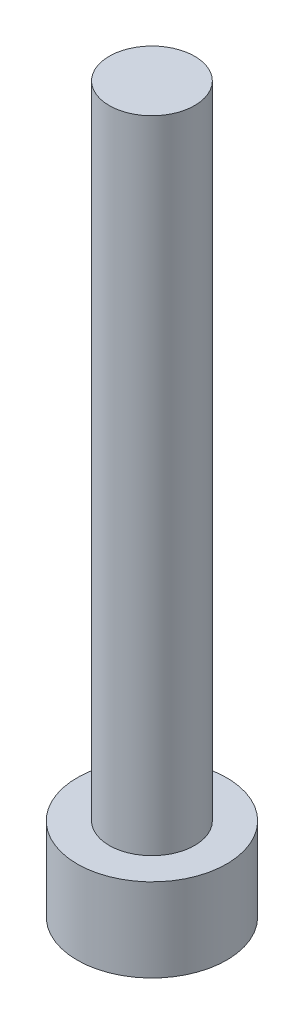
ISO-10303-21;
HEADER;
FILE_DESCRIPTION(('STEP AP214'),'2;1');
FILE_NAME('part.step','',(''),(''),'','','');
FILE_SCHEMA(('AUTOMOTIVE_DESIGN { 1 0 10303 214 1 1 1 1 }'));
ENDSEC;
DATA;
#1=APPLICATION_CONTEXT('core data for automotive mechanical design processes');
#2=APPLICATION_PROTOCOL_DEFINITION('international standard','automotive_design',2000,#1);
#3=PRODUCT_CONTEXT('',#1,'mechanical');
#4=PRODUCT('Part','Part','',(#3));
#5=PRODUCT_RELATED_PRODUCT_CATEGORY('part','',(#4));
#6=PRODUCT_DEFINITION_FORMATION('','',#4);
#7=PRODUCT_DEFINITION_CONTEXT('part definition',#1,'design');
#8=PRODUCT_DEFINITION('design','',#6,#7);
#9=PRODUCT_DEFINITION_SHAPE('','',#8);
#10=(LENGTH_UNIT() NAMED_UNIT(*) SI_UNIT(.MILLI.,.METRE.));
#11=(NAMED_UNIT(*) PLANE_ANGLE_UNIT() SI_UNIT($,.RADIAN.));
#12=(NAMED_UNIT(*) SI_UNIT($,.STERADIAN.) SOLID_ANGLE_UNIT());
#13=UNCERTAINTY_MEASURE_WITH_UNIT(LENGTH_MEASURE(1.E-05),#10,'distance_accuracy_value','');
#14=(GEOMETRIC_REPRESENTATION_CONTEXT(3) GLOBAL_UNCERTAINTY_ASSIGNED_CONTEXT((#13)) GLOBAL_UNIT_ASSIGNED_CONTEXT((#10,
#11,#12)) REPRESENTATION_CONTEXT('',''));
#15=CARTESIAN_POINT('',(0.,0.,0.));
#16=DIRECTION('',(0.,0.,1.));
#17=DIRECTION('',(1.,0.,0.));
#18=AXIS2_PLACEMENT_3D('',#15,#16,#17);
#19=CARTESIAN_POINT('',(0.,3.9,0.));
#20=DIRECTION('',(0.,-1.,0.));
#21=DIRECTION('',(0.,0.,-1.));
#22=AXIS2_PLACEMENT_3D('',#19,#20,#21);
#23=CYLINDRICAL_SURFACE('',#22,3.5);
#24=CARTESIAN_POINT('',(0.,3.9,0.));
#25=DIRECTION('',(0.,1.,0.));
#26=DIRECTION('',(0.,0.,1.));
#27=AXIS2_PLACEMENT_3D('',#24,#25,#26);
#28=CIRCLE('',#27,3.5);
#29=CARTESIAN_POINT('',(0.,3.9,3.5));
#30=VERTEX_POINT('',#29);
#31=EDGE_CURVE('E43',#30,#30,#28,.T.);
#32=ORIENTED_EDGE('',*,*,#31,.F.);
#33=EDGE_LOOP('',(#32));
#34=FACE_BOUND('',#33,.T.);
#35=CARTESIAN_POINT('',(0.,0.,0.));
#36=DIRECTION('',(0.,1.,0.));
#37=DIRECTION('',(0.,0.,1.));
#38=AXIS2_PLACEMENT_3D('',#35,#36,#37);
#39=CIRCLE('',#38,3.5);
#40=CARTESIAN_POINT('',(0.,0.,3.5));
#41=VERTEX_POINT('',#40);
#42=EDGE_CURVE('E38',#41,#41,#39,.T.);
#43=ORIENTED_EDGE('',*,*,#42,.T.);
#44=EDGE_LOOP('',(#43));
#45=FACE_BOUND('',#44,.T.);
#46=ADVANCED_FACE('F35',(#34,#45),#23,.T.);
#47=CARTESIAN_POINT('',(0.,3.9,0.));
#48=DIRECTION('',(0.,1.,0.));
#49=DIRECTION('',(0.,0.,1.));
#50=AXIS2_PLACEMENT_3D('',#47,#48,#49);
#51=PLANE('',#50);
#52=CARTESIAN_POINT('',(0.,3.9,0.));
#53=DIRECTION('',(0.,1.,0.));
#54=DIRECTION('',(0.,0.,1.));
#55=AXIS2_PLACEMENT_3D('',#52,#53,#54);
#56=CIRCLE('',#55,2.);
#57=CARTESIAN_POINT('',(0.,3.9,2.));
#58=VERTEX_POINT('',#57);
#59=EDGE_CURVE('E11',#58,#58,#56,.T.);
#60=ORIENTED_EDGE('',*,*,#59,.F.);
#61=EDGE_LOOP('',(#60));
#62=FACE_BOUND('',#61,.T.);
#63=ORIENTED_EDGE('',*,*,#31,.T.);
#64=EDGE_LOOP('',(#63));
#65=FACE_BOUND('',#64,.T.);
#66=ADVANCED_FACE('F155',(#62,#65),#51,.T.);
#67=CARTESIAN_POINT('',(0.,0.,0.));
#68=DIRECTION('',(0.,1.,0.));
#69=DIRECTION('',(0.,0.,1.));
#70=AXIS2_PLACEMENT_3D('',#67,#68,#69);
#71=PLANE('',#70);
#72=DIRECTION('',(-0.5,0.,0.866025403784438));
#73=VECTOR('',#72,1.);
#74=CARTESIAN_POINT('',(1.725,0.,0.));
#75=LINE('',#74,#73);
#76=CARTESIAN_POINT('',(1.725,0.,0.));
#77=VERTEX_POINT('',#76);
#78=CARTESIAN_POINT('',(0.862499999999999,0.,1.49389382152816));
#79=VERTEX_POINT('',#78);
#80=EDGE_CURVE('E125',#77,#79,#75,.T.);
#81=ORIENTED_EDGE('',*,*,#80,.F.);
#82=DIRECTION('',(0.5,0.,0.866025403784439));
#83=VECTOR('',#82,1.);
#84=CARTESIAN_POINT('',(0.8625,0.,-1.49389382152816));
#85=LINE('',#84,#83);
#86=CARTESIAN_POINT('',(0.8625,0.,-1.49389382152816));
#87=VERTEX_POINT('',#86);
#88=EDGE_CURVE('E51',#87,#77,#85,.T.);
#89=ORIENTED_EDGE('',*,*,#88,.F.);
#90=DIRECTION('',(1.,0.,0.));
#91=VECTOR('',#90,1.);
#92=CARTESIAN_POINT('',(-0.8625,0.,-1.49389382152816));
#93=LINE('',#92,#91);
#94=CARTESIAN_POINT('',(-0.8625,0.,-1.49389382152816));
#95=VERTEX_POINT('',#94);
#96=EDGE_CURVE('E134',#95,#87,#93,.T.);
#97=ORIENTED_EDGE('',*,*,#96,.F.);
#98=DIRECTION('',(0.5,0.,-0.866025403784439));
#99=VECTOR('',#98,1.);
#100=CARTESIAN_POINT('',(-1.725,0.,0.));
#101=LINE('',#100,#99);
#102=CARTESIAN_POINT('',(-1.725,0.,0.));
#103=VERTEX_POINT('',#102);
#104=EDGE_CURVE('E132',#103,#95,#101,.T.);
#105=ORIENTED_EDGE('',*,*,#104,.F.);
#106=DIRECTION('',(-0.5,0.,-0.866025403784439));
#107=VECTOR('',#106,1.);
#108=CARTESIAN_POINT('',(-0.8625,0.,1.49389382152816));
#109=LINE('',#108,#107);
#110=CARTESIAN_POINT('',(-0.8625,0.,1.49389382152816));
#111=VERTEX_POINT('',#110);
#112=EDGE_CURVE('E99',#111,#103,#109,.T.);
#113=ORIENTED_EDGE('',*,*,#112,.F.);
#114=DIRECTION('',(-1.,0.,0.));
#115=VECTOR('',#114,1.);
#116=CARTESIAN_POINT('',(0.862499999999999,0.,1.49389382152816));
#117=LINE('',#116,#115);
#118=EDGE_CURVE('E128',#79,#111,#117,.T.);
#119=ORIENTED_EDGE('',*,*,#118,.F.);
#120=EDGE_LOOP('',(#81,#89,#97,#105,#113,#119));
#121=FACE_BOUND('',#120,.T.);
#122=ORIENTED_EDGE('',*,*,#42,.F.);
#123=EDGE_LOOP('',(#122));
#124=FACE_BOUND('',#123,.T.);
#125=ADVANCED_FACE('F152',(#121,#124),#71,.F.);
#126=CARTESIAN_POINT('',(0.,33.9,0.));
#127=DIRECTION('',(0.,-1.,0.));
#128=DIRECTION('',(0.,0.,-1.));
#129=AXIS2_PLACEMENT_3D('',#126,#127,#128);
#130=CYLINDRICAL_SURFACE('',#129,2.);
#131=CARTESIAN_POINT('',(0.,33.9,0.));
#132=DIRECTION('',(0.,1.,0.));
#133=DIRECTION('',(0.,0.,1.));
#134=AXIS2_PLACEMENT_3D('',#131,#132,#133);
#135=CIRCLE('',#134,2.);
#136=CARTESIAN_POINT('',(0.,33.9,2.));
#137=VERTEX_POINT('',#136);
#138=EDGE_CURVE('E138',#137,#137,#135,.T.);
#139=ORIENTED_EDGE('',*,*,#138,.F.);
#140=EDGE_LOOP('',(#139));
#141=FACE_BOUND('',#140,.T.);
#142=ORIENTED_EDGE('',*,*,#59,.T.);
#143=EDGE_LOOP('',(#142));
#144=FACE_BOUND('',#143,.T.);
#145=ADVANCED_FACE('F154',(#141,#144),#130,.T.);
#146=CARTESIAN_POINT('',(0.,33.9,0.));
#147=DIRECTION('',(0.,1.,0.));
#148=DIRECTION('',(0.,0.,1.));
#149=AXIS2_PLACEMENT_3D('',#146,#147,#148);
#150=PLANE('',#149);
#151=ORIENTED_EDGE('',*,*,#138,.T.);
#152=EDGE_LOOP('',(#151));
#153=FACE_BOUND('',#152,.T.);
#154=ADVANCED_FACE('F161',(#153),#150,.T.);
#155=CARTESIAN_POINT('',(0.8625,2.4,-1.49389382152816));
#156=DIRECTION('',(0.866025403784439,0.,-0.5));
#157=DIRECTION('',(-0.5,0.,-0.866025403784439));
#158=AXIS2_PLACEMENT_3D('',#155,#156,#157);
#159=PLANE('',#158);
#160=ORIENTED_EDGE('',*,*,#88,.T.);
#161=DIRECTION('',(0.,-1.,0.));
#162=VECTOR('',#161,1.);
#163=CARTESIAN_POINT('',(1.725,2.4,0.));
#164=LINE('',#163,#162);
#165=CARTESIAN_POINT('',(1.725,2.4,0.));
#166=VERTEX_POINT('',#165);
#167=EDGE_CURVE('E81',#166,#77,#164,.T.);
#168=ORIENTED_EDGE('',*,*,#167,.F.);
#169=DIRECTION('',(0.5,0.,0.866025403784439));
#170=VECTOR('',#169,1.);
#171=CARTESIAN_POINT('',(0.8625,2.4,-1.49389382152816));
#172=LINE('',#171,#170);
#173=CARTESIAN_POINT('',(0.8625,2.4,-1.49389382152816));
#174=VERTEX_POINT('',#173);
#175=EDGE_CURVE('E136',#174,#166,#172,.T.);
#176=ORIENTED_EDGE('',*,*,#175,.F.);
#177=DIRECTION('',(0.,-1.,0.));
#178=VECTOR('',#177,1.);
#179=CARTESIAN_POINT('',(0.8625,2.4,-1.49389382152816));
#180=LINE('',#179,#178);
#181=EDGE_CURVE('E59',#174,#87,#180,.T.);
#182=ORIENTED_EDGE('',*,*,#181,.T.);
#183=EDGE_LOOP('',(#160,#168,#176,#182));
#184=FACE_BOUND('',#183,.T.);
#185=ADVANCED_FACE('F190',(#184),#159,.F.);
#186=CARTESIAN_POINT('',(-0.8625,2.4,-1.49389382152816));
#187=DIRECTION('',(0.,0.,-1.));
#188=DIRECTION('',(-1.,0.,0.));
#189=AXIS2_PLACEMENT_3D('',#186,#187,#188);
#190=PLANE('',#189);
#191=ORIENTED_EDGE('',*,*,#96,.T.);
#192=ORIENTED_EDGE('',*,*,#181,.F.);
#193=DIRECTION('',(1.,0.,0.));
#194=VECTOR('',#193,1.);
#195=CARTESIAN_POINT('',(-0.8625,2.4,-1.49389382152816));
#196=LINE('',#195,#194);
#197=CARTESIAN_POINT('',(-0.8625,2.4,-1.49389382152816));
#198=VERTEX_POINT('',#197);
#199=EDGE_CURVE('E111',#198,#174,#196,.T.);
#200=ORIENTED_EDGE('',*,*,#199,.F.);
#201=DIRECTION('',(0.,-1.,0.));
#202=VECTOR('',#201,1.);
#203=CARTESIAN_POINT('',(-0.8625,2.4,-1.49389382152816));
#204=LINE('',#203,#202);
#205=EDGE_CURVE('E103',#198,#95,#204,.T.);
#206=ORIENTED_EDGE('',*,*,#205,.T.);
#207=EDGE_LOOP('',(#191,#192,#200,#206));
#208=FACE_BOUND('',#207,.T.);
#209=ADVANCED_FACE('F204',(#208),#190,.F.);
#210=CARTESIAN_POINT('',(-1.725,2.4,0.));
#211=DIRECTION('',(-0.866025403784439,0.,-0.5));
#212=DIRECTION('',(-0.5,0.,0.866025403784439));
#213=AXIS2_PLACEMENT_3D('',#210,#211,#212);
#214=PLANE('',#213);
#215=ORIENTED_EDGE('',*,*,#104,.T.);
#216=ORIENTED_EDGE('',*,*,#205,.F.);
#217=DIRECTION('',(0.5,0.,-0.866025403784439));
#218=VECTOR('',#217,1.);
#219=CARTESIAN_POINT('',(-1.725,2.4,0.));
#220=LINE('',#219,#218);
#221=CARTESIAN_POINT('',(-1.725,2.4,0.));
#222=VERTEX_POINT('',#221);
#223=EDGE_CURVE('E107',#222,#198,#220,.T.);
#224=ORIENTED_EDGE('',*,*,#223,.F.);
#225=DIRECTION('',(0.,-1.,0.));
#226=VECTOR('',#225,1.);
#227=CARTESIAN_POINT('',(-1.725,2.4,0.));
#228=LINE('',#227,#226);
#229=EDGE_CURVE('E92',#222,#103,#228,.T.);
#230=ORIENTED_EDGE('',*,*,#229,.T.);
#231=EDGE_LOOP('',(#215,#216,#224,#230));
#232=FACE_BOUND('',#231,.T.);
#233=ADVANCED_FACE('F108',(#232),#214,.F.);
#234=CARTESIAN_POINT('',(-0.8625,2.4,1.49389382152816));
#235=DIRECTION('',(-0.866025403784439,0.,0.5));
#236=DIRECTION('',(0.5,0.,0.866025403784439));
#237=AXIS2_PLACEMENT_3D('',#234,#235,#236);
#238=PLANE('',#237);
#239=ORIENTED_EDGE('',*,*,#112,.T.);
#240=ORIENTED_EDGE('',*,*,#229,.F.);
#241=DIRECTION('',(-0.5,0.,-0.866025403784439));
#242=VECTOR('',#241,1.);
#243=CARTESIAN_POINT('',(-0.8625,2.4,1.49389382152816));
#244=LINE('',#243,#242);
#245=CARTESIAN_POINT('',(-0.8625,2.4,1.49389382152816));
#246=VERTEX_POINT('',#245);
#247=EDGE_CURVE('E96',#246,#222,#244,.T.);
#248=ORIENTED_EDGE('',*,*,#247,.F.);
#249=DIRECTION('',(0.,-1.,0.));
#250=VECTOR('',#249,1.);
#251=CARTESIAN_POINT('',(-0.8625,2.4,1.49389382152816));
#252=LINE('',#251,#250);
#253=EDGE_CURVE('E104',#246,#111,#252,.T.);
#254=ORIENTED_EDGE('',*,*,#253,.T.);
#255=EDGE_LOOP('',(#239,#240,#248,#254));
#256=FACE_BOUND('',#255,.T.);
#257=ADVANCED_FACE('F94',(#256),#238,.F.);
#258=CARTESIAN_POINT('',(0.862499999999999,2.4,1.49389382152816));
#259=DIRECTION('',(0.,0.,1.));
#260=DIRECTION('',(1.,0.,0.));
#261=AXIS2_PLACEMENT_3D('',#258,#259,#260);
#262=PLANE('',#261);
#263=ORIENTED_EDGE('',*,*,#118,.T.);
#264=ORIENTED_EDGE('',*,*,#253,.F.);
#265=DIRECTION('',(-1.,0.,0.));
#266=VECTOR('',#265,1.);
#267=CARTESIAN_POINT('',(0.862499999999999,2.4,1.49389382152816));
#268=LINE('',#267,#266);
#269=CARTESIAN_POINT('',(0.862499999999999,2.4,1.49389382152816));
#270=VERTEX_POINT('',#269);
#271=EDGE_CURVE('E117',#270,#246,#268,.T.);
#272=ORIENTED_EDGE('',*,*,#271,.F.);
#273=DIRECTION('',(0.,-1.,0.));
#274=VECTOR('',#273,1.);
#275=CARTESIAN_POINT('',(0.862499999999999,2.4,1.49389382152816));
#276=LINE('',#275,#274);
#277=EDGE_CURVE('E141',#270,#79,#276,.T.);
#278=ORIENTED_EDGE('',*,*,#277,.T.);
#279=EDGE_LOOP('',(#263,#264,#272,#278));
#280=FACE_BOUND('',#279,.T.);
#281=ADVANCED_FACE('F229',(#280),#262,.F.);
#282=CARTESIAN_POINT('',(1.725,2.4,0.));
#283=DIRECTION('',(0.866025403784439,0.,0.5));
#284=DIRECTION('',(0.5,0.,-0.866025403784439));
#285=AXIS2_PLACEMENT_3D('',#282,#283,#284);
#286=PLANE('',#285);
#287=ORIENTED_EDGE('',*,*,#80,.T.);
#288=ORIENTED_EDGE('',*,*,#277,.F.);
#289=DIRECTION('',(-0.5,0.,0.866025403784438));
#290=VECTOR('',#289,1.);
#291=CARTESIAN_POINT('',(1.725,2.4,0.));
#292=LINE('',#291,#290);
#293=EDGE_CURVE('E119',#166,#270,#292,.T.);
#294=ORIENTED_EDGE('',*,*,#293,.F.);
#295=ORIENTED_EDGE('',*,*,#167,.T.);
#296=EDGE_LOOP('',(#287,#288,#294,#295));
#297=FACE_BOUND('',#296,.T.);
#298=ADVANCED_FACE('F238',(#297),#286,.F.);
#299=CARTESIAN_POINT('',(0.,2.4,0.));
#300=DIRECTION('',(0.,-1.,0.));
#301=DIRECTION('',(0.,0.,-1.));
#302=AXIS2_PLACEMENT_3D('',#299,#300,#301);
#303=PLANE('',#302);
#304=ORIENTED_EDGE('',*,*,#175,.T.);
#305=ORIENTED_EDGE('',*,*,#293,.T.);
#306=ORIENTED_EDGE('',*,*,#271,.T.);
#307=ORIENTED_EDGE('',*,*,#247,.T.);
#308=ORIENTED_EDGE('',*,*,#223,.T.);
#309=ORIENTED_EDGE('',*,*,#199,.T.);
#310=EDGE_LOOP('',(#304,#305,#306,#307,#308,#309));
#311=FACE_BOUND('',#310,.T.);
#312=ADVANCED_FACE('F114',(#311),#303,.T.);
#313=CLOSED_SHELL('',(#46,#66,#125,#145,#154,#185,#209,#233,#257,#281,#298,#312));
#314=MANIFOLD_SOLID_BREP('B2',#313);
#315=ADVANCED_BREP_SHAPE_REPRESENTATION('',(#18,#314),#14);
#316=SHAPE_DEFINITION_REPRESENTATION(#9,#315);
ENDSEC;
END-ISO-10303-21;
